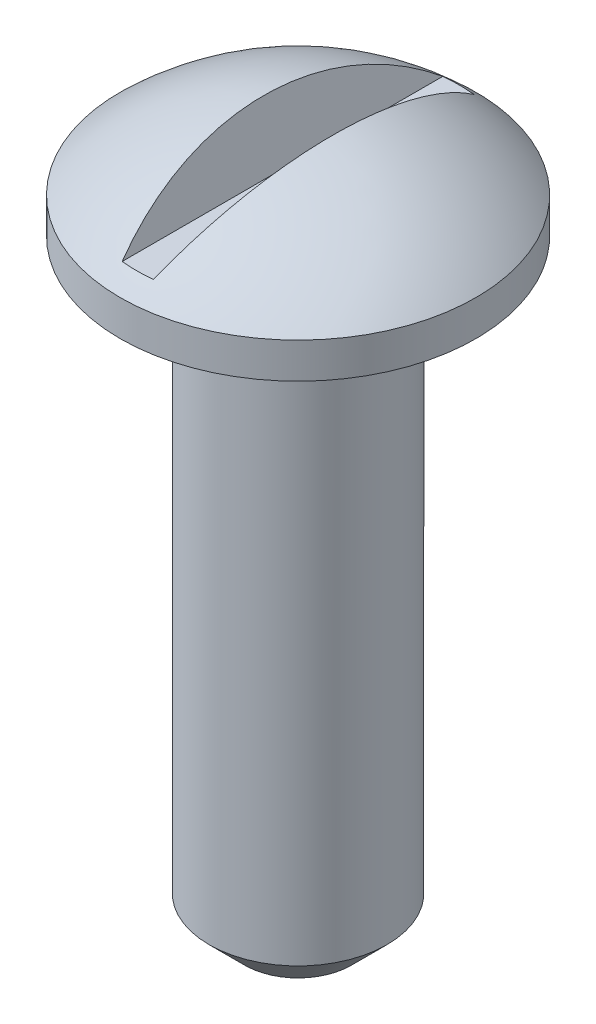
ISO-10303-21;
HEADER;
FILE_DESCRIPTION(('STEP AP214'),'2;1');
FILE_NAME('part.step','',(''),(''),'','','');
FILE_SCHEMA(('AUTOMOTIVE_DESIGN { 1 0 10303 214 1 1 1 1 }'));
ENDSEC;
DATA;
#1=APPLICATION_CONTEXT('core data for automotive mechanical design processes');
#2=APPLICATION_PROTOCOL_DEFINITION('international standard','automotive_design',2000,#1);
#3=PRODUCT_CONTEXT('',#1,'mechanical');
#4=PRODUCT('Part','Part','',(#3));
#5=PRODUCT_RELATED_PRODUCT_CATEGORY('part','',(#4));
#6=PRODUCT_DEFINITION_FORMATION('','',#4);
#7=PRODUCT_DEFINITION_CONTEXT('part definition',#1,'design');
#8=PRODUCT_DEFINITION('design','',#6,#7);
#9=PRODUCT_DEFINITION_SHAPE('','',#8);
#10=(LENGTH_UNIT() NAMED_UNIT(*) SI_UNIT(.MILLI.,.METRE.));
#11=(NAMED_UNIT(*) PLANE_ANGLE_UNIT() SI_UNIT($,.RADIAN.));
#12=(NAMED_UNIT(*) SI_UNIT($,.STERADIAN.) SOLID_ANGLE_UNIT());
#13=UNCERTAINTY_MEASURE_WITH_UNIT(LENGTH_MEASURE(1.E-05),#10,'distance_accuracy_value','');
#14=(GEOMETRIC_REPRESENTATION_CONTEXT(3) GLOBAL_UNCERTAINTY_ASSIGNED_CONTEXT((#13)) GLOBAL_UNIT_ASSIGNED_CONTEXT((#10,
#11,#12)) REPRESENTATION_CONTEXT('',''));
#15=CARTESIAN_POINT('',(0.,0.,0.));
#16=DIRECTION('',(0.,0.,1.));
#17=DIRECTION('',(1.,0.,0.));
#18=AXIS2_PLACEMENT_3D('',#15,#16,#17);
#19=CARTESIAN_POINT('',(0.,0.,0.));
#20=DIRECTION('',(0.,-1.,0.));
#21=DIRECTION('',(0.,0.,-1.));
#22=AXIS2_PLACEMENT_3D('',#19,#20,#21);
#23=PLANE('',#22);
#24=CARTESIAN_POINT('',(0.,0.,0.));
#25=DIRECTION('',(0.,-1.,0.));
#26=DIRECTION('',(0.,0.,-1.));
#27=AXIS2_PLACEMENT_3D('',#24,#25,#26);
#28=CIRCLE('',#27,3.80999999999999);
#29=CARTESIAN_POINT('',(0.,0.,-3.80999999999999));
#30=VERTEX_POINT('',#29);
#31=EDGE_CURVE('E11',#30,#30,#28,.T.);
#32=ORIENTED_EDGE('',*,*,#31,.T.);
#33=EDGE_LOOP('',(#32));
#34=FACE_BOUND('',#33,.T.);
#35=ADVANCED_FACE('F47',(#34),#23,.T.);
#36=CARTESIAN_POINT('',(0.,0.,0.));
#37=DIRECTION('',(0.,1.,0.));
#38=DIRECTION('',(0.,0.,1.));
#39=AXIS2_PLACEMENT_3D('',#36,#37,#38);
#40=CYLINDRICAL_SURFACE('',#39,6.35);
#41=CARTESIAN_POINT('',(0.,2.54,0.));
#42=DIRECTION('',(0.,-1.,0.));
#43=DIRECTION('',(0.,0.,-1.));
#44=AXIS2_PLACEMENT_3D('',#41,#42,#43);
#45=CIRCLE('',#44,6.35);
#46=CARTESIAN_POINT('',(0.,2.54,-6.35));
#47=VERTEX_POINT('',#46);
#48=EDGE_CURVE('E57',#47,#47,#45,.F.);
#49=ORIENTED_EDGE('',*,*,#48,.T.);
#50=EDGE_LOOP('',(#49));
#51=FACE_BOUND('',#50,.T.);
#52=CARTESIAN_POINT('',(0.,43.18,0.));
#53=DIRECTION('',(0.,1.,0.));
#54=DIRECTION('',(0.,0.,1.));
#55=AXIS2_PLACEMENT_3D('',#52,#53,#54);
#56=CIRCLE('',#55,6.35);
#57=CARTESIAN_POINT('',(0.,43.18,6.35));
#58=VERTEX_POINT('',#57);
#59=EDGE_CURVE('E82',#58,#58,#56,.T.);
#60=ORIENTED_EDGE('',*,*,#59,.F.);
#61=EDGE_LOOP('',(#60));
#62=FACE_BOUND('',#61,.T.);
#63=ADVANCED_FACE('F115',(#51,#62),#40,.T.);
#64=CARTESIAN_POINT('',(-6.35,43.18,0.));
#65=DIRECTION('',(0.,-1.,0.));
#66=DIRECTION('',(0.,0.,-1.));
#67=AXIS2_PLACEMENT_3D('',#64,#65,#66);
#68=PLANE('',#67);
#69=ORIENTED_EDGE('',*,*,#59,.T.);
#70=EDGE_LOOP('',(#69));
#71=FACE_BOUND('',#70,.T.);
#72=CARTESIAN_POINT('',(0.,43.18,0.));
#73=DIRECTION('',(0.,1.,0.));
#74=DIRECTION('',(0.,0.,1.));
#75=AXIS2_PLACEMENT_3D('',#72,#73,#74);
#76=CIRCLE('',#75,12.7);
#77=CARTESIAN_POINT('',(0.,43.18,12.7));
#78=VERTEX_POINT('',#77);
#79=EDGE_CURVE('E99',#78,#78,#76,.T.);
#80=ORIENTED_EDGE('',*,*,#79,.F.);
#81=EDGE_LOOP('',(#80));
#82=FACE_BOUND('',#81,.T.);
#83=ADVANCED_FACE('F131',(#71,#82),#68,.T.);
#84=CARTESIAN_POINT('',(0.,0.,0.));
#85=DIRECTION('',(0.,1.,0.));
#86=DIRECTION('',(0.,0.,1.));
#87=AXIS2_PLACEMENT_3D('',#84,#85,#86);
#88=CYLINDRICAL_SURFACE('',#87,12.7);
#89=ORIENTED_EDGE('',*,*,#79,.T.);
#90=EDGE_LOOP('',(#89));
#91=FACE_BOUND('',#90,.T.);
#92=CARTESIAN_POINT('',(0.,45.72,0.));
#93=DIRECTION('',(0.,1.,0.));
#94=DIRECTION('',(0.,0.,1.));
#95=AXIS2_PLACEMENT_3D('',#92,#93,#94);
#96=CIRCLE('',#95,12.7);
#97=CARTESIAN_POINT('',(0.,45.72,12.7));
#98=VERTEX_POINT('',#97);
#99=EDGE_CURVE('E96',#98,#98,#96,.T.);
#100=ORIENTED_EDGE('',*,*,#99,.F.);
#101=EDGE_LOOP('',(#100));
#102=FACE_BOUND('',#101,.T.);
#103=ADVANCED_FACE('F136',(#91,#102),#88,.T.);
#104=CARTESIAN_POINT('',(0.,32.385,0.));
#105=DIRECTION('',(0.,0.,1.));
#106=DIRECTION('',(1.,0.,0.));
#107=AXIS2_PLACEMENT_3D('',#104,#105,#106);
#108=SPHERICAL_SURFACE('',#107,18.415);
#109=CARTESIAN_POINT('',(3.47597192106101,33.5957780713583,0.));
#110=DIRECTION('',(-0.944349655238003,-0.328943351736837,0.));
#111=DIRECTION('',(0.328943351736837,-0.944349655238003,0.));
#112=AXIS2_PLACEMENT_3D('',#109,#110,#111);
#113=CIRCLE('',#112,18.0433882811936);
#114=CARTESIAN_POINT('',(-1.11246074015574,46.7685167171583,-11.4450470924693));
#115=VERTEX_POINT('',#114);
#116=CARTESIAN_POINT('',(-1.11246074015574,46.7685167171583,11.4450470924693));
#117=VERTEX_POINT('',#116);
#118=EDGE_CURVE('E68',#115,#117,#113,.F.);
#119=ORIENTED_EDGE('',*,*,#118,.F.);
#120=CARTESIAN_POINT('',(0.,46.7685167171583,0.));
#121=DIRECTION('',(0.,-1.,0.));
#122=DIRECTION('',(0.,0.,-1.));
#123=AXIS2_PLACEMENT_3D('',#120,#121,#122);
#124=CIRCLE('',#123,11.4989856877564);
#125=CARTESIAN_POINT('',(1.11246074015574,46.7685167171583,-11.4450470924693));
#126=VERTEX_POINT('',#125);
#127=EDGE_CURVE('E77',#126,#115,#124,.F.);
#128=ORIENTED_EDGE('',*,*,#127,.F.);
#129=CARTESIAN_POINT('',(-3.47597192106101,33.5957780713583,0.));
#130=DIRECTION('',(0.944349655238003,-0.328943351736837,0.));
#131=DIRECTION('',(0.328943351736837,0.944349655238003,0.));
#132=AXIS2_PLACEMENT_3D('',#129,#130,#131);
#133=CIRCLE('',#132,18.0433882811936);
#134=CARTESIAN_POINT('',(1.11246074015574,46.7685167171583,11.4450470924693));
#135=VERTEX_POINT('',#134);
#136=EDGE_CURVE('E74',#135,#126,#133,.F.);
#137=ORIENTED_EDGE('',*,*,#136,.F.);
#138=EDGE_CURVE('E64',#117,#135,#124,.F.);
#139=ORIENTED_EDGE('',*,*,#138,.F.);
#140=EDGE_LOOP('',(#119,#128,#137,#139));
#141=FACE_BOUND('',#140,.T.);
#142=ORIENTED_EDGE('',*,*,#99,.T.);
#143=EDGE_LOOP('',(#142));
#144=FACE_BOUND('',#143,.T.);
#145=ADVANCED_FACE('F75',(#141,#144),#108,.T.);
#146=CARTESIAN_POINT('',(-2.45928069684398,50.6350455740289,85.7087993333659));
#147=DIRECTION('',(-0.944349655238003,-0.328943351736837,0.));
#148=DIRECTION('',(0.328943351736837,-0.944349655238003,0.));
#149=AXIS2_PLACEMENT_3D('',#146,#147,#148);
#150=PLANE('',#149);
#151=DIRECTION('',(0.,0.,-1.));
#152=VECTOR('',#151,1.);
#153=CARTESIAN_POINT('',(-1.11246074015574,46.7685167171583,85.7087993333659));
#154=LINE('',#153,#152);
#155=EDGE_CURVE('E89',#117,#115,#154,.T.);
#156=ORIENTED_EDGE('',*,*,#155,.T.);
#157=ORIENTED_EDGE('',*,*,#118,.T.);
#158=EDGE_LOOP('',(#156,#157));
#159=FACE_BOUND('',#158,.T.);
#160=ADVANCED_FACE('F135',(#159),#150,.F.);
#161=CARTESIAN_POINT('',(-1.11246074015574,46.7685167171583,85.7087993333659));
#162=DIRECTION('',(0.,-1.,0.));
#163=DIRECTION('',(0.,0.,-1.));
#164=AXIS2_PLACEMENT_3D('',#161,#162,#163);
#165=PLANE('',#164);
#166=ORIENTED_EDGE('',*,*,#155,.F.);
#167=ORIENTED_EDGE('',*,*,#138,.T.);
#168=DIRECTION('',(0.,0.,-1.));
#169=VECTOR('',#168,1.);
#170=CARTESIAN_POINT('',(1.11246074015574,46.7685167171583,85.7087993333659));
#171=LINE('',#170,#169);
#172=EDGE_CURVE('E87',#135,#126,#171,.T.);
#173=ORIENTED_EDGE('',*,*,#172,.T.);
#174=ORIENTED_EDGE('',*,*,#127,.T.);
#175=EDGE_LOOP('',(#166,#167,#173,#174));
#176=FACE_BOUND('',#175,.T.);
#177=ADVANCED_FACE('F86',(#176),#165,.F.);
#178=CARTESIAN_POINT('',(2.45928069684398,50.6350455740289,85.7087993333659));
#179=DIRECTION('',(0.944349655238003,-0.328943351736837,0.));
#180=DIRECTION('',(0.328943351736837,0.944349655238003,0.));
#181=AXIS2_PLACEMENT_3D('',#178,#179,#180);
#182=PLANE('',#181);
#183=ORIENTED_EDGE('',*,*,#136,.T.);
#184=ORIENTED_EDGE('',*,*,#172,.F.);
#185=EDGE_LOOP('',(#183,#184));
#186=FACE_BOUND('',#185,.T.);
#187=ADVANCED_FACE('F92',(#186),#182,.F.);
#188=CARTESIAN_POINT('',(0.,2.54,0.));
#189=DIRECTION('',(0.,1.,0.));
#190=DIRECTION('',(0.,0.,1.));
#191=AXIS2_PLACEMENT_3D('',#188,#189,#190);
#192=CONICAL_SURFACE('',#191,6.35,0.78539816339745);
#193=ORIENTED_EDGE('',*,*,#31,.F.);
#194=EDGE_LOOP('',(#193));
#195=FACE_BOUND('',#194,.T.);
#196=ORIENTED_EDGE('',*,*,#48,.F.);
#197=EDGE_LOOP('',(#196));
#198=FACE_BOUND('',#197,.T.);
#199=ADVANCED_FACE('F50',(#195,#198),#192,.T.);
#200=CLOSED_SHELL('',(#35,#63,#83,#103,#145,#160,#177,#187,#199));
#201=MANIFOLD_SOLID_BREP('B2',#200);
#202=ADVANCED_BREP_SHAPE_REPRESENTATION('',(#18,#201),#14);
#203=SHAPE_DEFINITION_REPRESENTATION(#9,#202);
ENDSEC;
END-ISO-10303-21;
